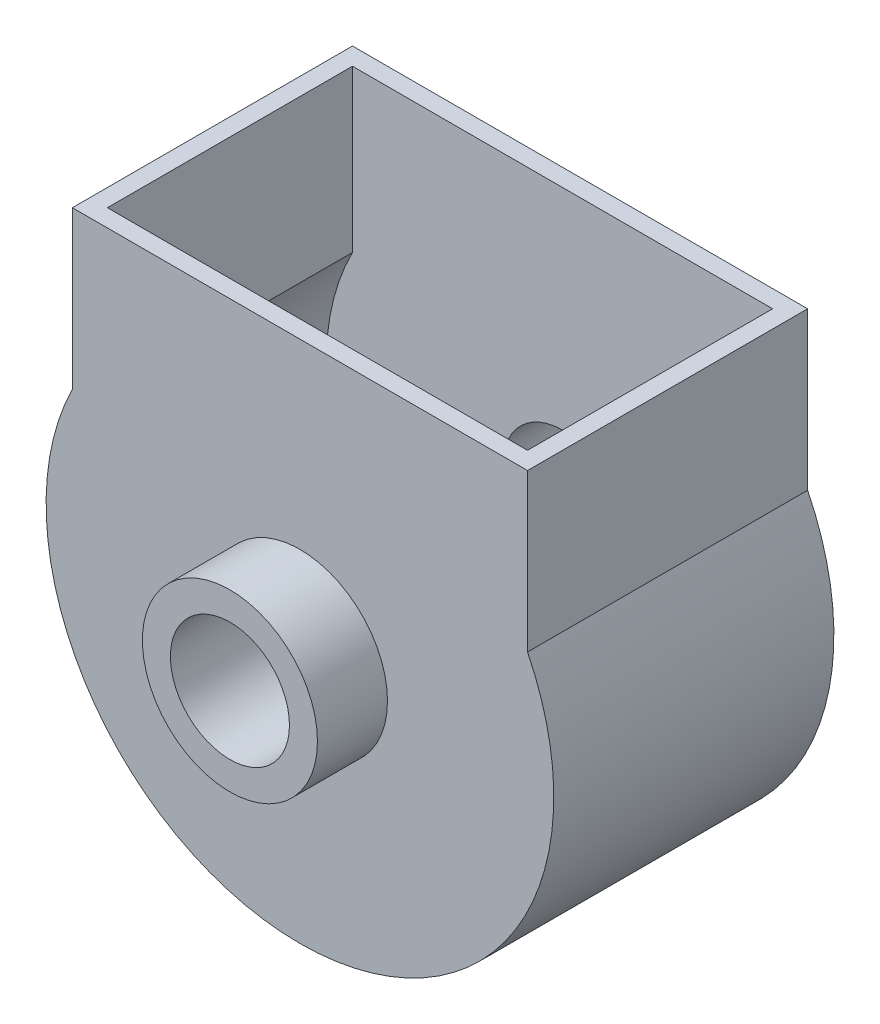
ISO-10303-21;
HEADER;
FILE_DESCRIPTION(('STEP AP214'),'2;1');
FILE_NAME('part.step','',(''),(''),'','','');
FILE_SCHEMA(('AUTOMOTIVE_DESIGN { 1 0 10303 214 1 1 1 1 }'));
ENDSEC;
DATA;
#1=APPLICATION_CONTEXT('core data for automotive mechanical design processes');
#2=APPLICATION_PROTOCOL_DEFINITION('international standard','automotive_design',2000,#1);
#3=PRODUCT_CONTEXT('',#1,'mechanical');
#4=PRODUCT('Part','Part','',(#3));
#5=PRODUCT_RELATED_PRODUCT_CATEGORY('part','',(#4));
#6=PRODUCT_DEFINITION_FORMATION('','',#4);
#7=PRODUCT_DEFINITION_CONTEXT('part definition',#1,'design');
#8=PRODUCT_DEFINITION('design','',#6,#7);
#9=PRODUCT_DEFINITION_SHAPE('','',#8);
#10=(LENGTH_UNIT() NAMED_UNIT(*) SI_UNIT(.MILLI.,.METRE.));
#11=(NAMED_UNIT(*) PLANE_ANGLE_UNIT() SI_UNIT($,.RADIAN.));
#12=(NAMED_UNIT(*) SI_UNIT($,.STERADIAN.) SOLID_ANGLE_UNIT());
#13=UNCERTAINTY_MEASURE_WITH_UNIT(LENGTH_MEASURE(1.E-05),#10,'distance_accuracy_value','');
#14=(GEOMETRIC_REPRESENTATION_CONTEXT(3) GLOBAL_UNCERTAINTY_ASSIGNED_CONTEXT((#13)) GLOBAL_UNIT_ASSIGNED_CONTEXT((#10,
#11,#12)) REPRESENTATION_CONTEXT('',''));
#15=CARTESIAN_POINT('',(0.,0.,0.));
#16=DIRECTION('',(0.,0.,1.));
#17=DIRECTION('',(1.,0.,0.));
#18=AXIS2_PLACEMENT_3D('',#15,#16,#17);
#19=CARTESIAN_POINT('',(0.,0.,-50.));
#20=DIRECTION('',(0.,0.,1.));
#21=DIRECTION('',(1.,0.,0.));
#22=AXIS2_PLACEMENT_3D('',#19,#20,#21);
#23=PLANE('',#22);
#24=CARTESIAN_POINT('',(0.,0.,-50.));
#25=DIRECTION('',(0.,0.,1.));
#26=DIRECTION('',(1.,0.,0.));
#27=AXIS2_PLACEMENT_3D('',#24,#25,#26);
#28=CIRCLE('',#27,170.);
#29=CARTESIAN_POINT('',(170.,0.,-50.));
#30=VERTEX_POINT('',#29);
#31=EDGE_CURVE('E52',#30,#30,#28,.T.);
#32=ORIENTED_EDGE('',*,*,#31,.T.);
#33=EDGE_LOOP('',(#32));
#34=FACE_BOUND('',#33,.T.);
#35=DIRECTION('',(0.,-1.,0.));
#36=VECTOR('',#35,1.);
#37=CARTESIAN_POINT('',(-600.,770.,-50.));
#38=LINE('',#37,#36);
#39=CARTESIAN_POINT('',(-600.,770.,-50.));
#40=VERTEX_POINT('',#39);
#41=CARTESIAN_POINT('',(-600.,309.232921921324,-50.));
#42=VERTEX_POINT('',#41);
#43=EDGE_CURVE('E165',#40,#42,#38,.T.);
#44=ORIENTED_EDGE('',*,*,#43,.F.);
#45=DIRECTION('',(-1.,0.,0.));
#46=VECTOR('',#45,1.);
#47=CARTESIAN_POINT('',(0.,770.,-50.));
#48=LINE('',#47,#46);
#49=CARTESIAN_POINT('',(600.,770.,-50.));
#50=VERTEX_POINT('',#49);
#51=EDGE_CURVE('E121',#50,#40,#48,.T.);
#52=ORIENTED_EDGE('',*,*,#51,.F.);
#53=DIRECTION('',(0.,1.,0.));
#54=VECTOR('',#53,1.);
#55=CARTESIAN_POINT('',(600.,309.232921921324,-50.));
#56=LINE('',#55,#54);
#57=CARTESIAN_POINT('',(600.,309.232921921324,-50.));
#58=VERTEX_POINT('',#57);
#59=EDGE_CURVE('E64',#58,#50,#56,.T.);
#60=ORIENTED_EDGE('',*,*,#59,.F.);
#61=CARTESIAN_POINT('',(0.,0.,-50.));
#62=DIRECTION('',(0.,0.,1.));
#63=DIRECTION('',(1.,0.,0.));
#64=AXIS2_PLACEMENT_3D('',#61,#62,#63);
#65=CIRCLE('',#64,675.);
#66=EDGE_CURVE('E59',#42,#58,#65,.T.);
#67=ORIENTED_EDGE('',*,*,#66,.F.);
#68=EDGE_LOOP('',(#44,#52,#60,#67));
#69=FACE_BOUND('',#68,.T.);
#70=ADVANCED_FACE('F43',(#34,#69),#23,.F.);
#71=CARTESIAN_POINT('',(0.,0.,-50.));
#72=DIRECTION('',(0.,0.,1.));
#73=DIRECTION('',(1.,0.,0.));
#74=AXIS2_PLACEMENT_3D('',#71,#72,#73);
#75=CYLINDRICAL_SURFACE('',#74,170.);
#76=ORIENTED_EDGE('',*,*,#31,.F.);
#77=EDGE_LOOP('',(#76));
#78=FACE_BOUND('',#77,.T.);
#79=CARTESIAN_POINT('',(0.,0.,200.));
#80=DIRECTION('',(0.,0.,1.));
#81=DIRECTION('',(1.,0.,0.));
#82=AXIS2_PLACEMENT_3D('',#79,#80,#81);
#83=CIRCLE('',#82,170.);
#84=CARTESIAN_POINT('',(170.,0.,200.));
#85=VERTEX_POINT('',#84);
#86=EDGE_CURVE('E213',#85,#85,#83,.T.);
#87=ORIENTED_EDGE('',*,*,#86,.T.);
#88=EDGE_LOOP('',(#87));
#89=FACE_BOUND('',#88,.T.);
#90=ADVANCED_FACE('F45',(#78,#89),#75,.F.);
#91=CARTESIAN_POINT('',(0.,0.,-50.));
#92=DIRECTION('',(0.,0.,1.));
#93=DIRECTION('',(1.,0.,0.));
#94=AXIS2_PLACEMENT_3D('',#91,#92,#93);
#95=CYLINDRICAL_SURFACE('',#94,250.);
#96=CARTESIAN_POINT('',(0.,0.,0.));
#97=DIRECTION('',(0.,0.,1.));
#98=DIRECTION('',(1.,0.,0.));
#99=AXIS2_PLACEMENT_3D('',#96,#97,#98);
#100=CIRCLE('',#99,250.);
#101=CARTESIAN_POINT('',(250.,0.,0.));
#102=VERTEX_POINT('',#101);
#103=EDGE_CURVE('E11',#102,#102,#100,.F.);
#104=ORIENTED_EDGE('',*,*,#103,.F.);
#105=EDGE_LOOP('',(#104));
#106=FACE_BOUND('',#105,.T.);
#107=CARTESIAN_POINT('',(0.,0.,200.));
#108=DIRECTION('',(0.,0.,1.));
#109=DIRECTION('',(1.,0.,0.));
#110=AXIS2_PLACEMENT_3D('',#107,#108,#109);
#111=CIRCLE('',#110,250.);
#112=CARTESIAN_POINT('',(250.,0.,200.));
#113=VERTEX_POINT('',#112);
#114=EDGE_CURVE('E222',#113,#113,#111,.T.);
#115=ORIENTED_EDGE('',*,*,#114,.F.);
#116=EDGE_LOOP('',(#115));
#117=FACE_BOUND('',#116,.T.);
#118=ADVANCED_FACE('F232',(#106,#117),#95,.T.);
#119=CARTESIAN_POINT('',(0.,0.,200.));
#120=DIRECTION('',(0.,0.,1.));
#121=DIRECTION('',(1.,0.,0.));
#122=AXIS2_PLACEMENT_3D('',#119,#120,#121);
#123=PLANE('',#122);
#124=ORIENTED_EDGE('',*,*,#86,.F.);
#125=EDGE_LOOP('',(#124));
#126=FACE_BOUND('',#125,.T.);
#127=ORIENTED_EDGE('',*,*,#114,.T.);
#128=EDGE_LOOP('',(#127));
#129=FACE_BOUND('',#128,.T.);
#130=ADVANCED_FACE('F235',(#126,#129),#123,.T.);
#131=CARTESIAN_POINT('',(-650.,0.,-50.));
#132=DIRECTION('',(-1.,0.,0.));
#133=DIRECTION('',(0.,0.,1.));
#134=AXIS2_PLACEMENT_3D('',#131,#132,#133);
#135=PLANE('',#134);
#136=DIRECTION('',(0.,-1.,0.));
#137=VECTOR('',#136,1.);
#138=CARTESIAN_POINT('',(-650.,0.,0.));
#139=LINE('',#138,#137);
#140=CARTESIAN_POINT('',(-650.,770.,0.));
#141=VERTEX_POINT('',#140);
#142=CARTESIAN_POINT('',(-650.,321.130814466628,0.));
#143=VERTEX_POINT('',#142);
#144=EDGE_CURVE('E185',#141,#143,#139,.T.);
#145=ORIENTED_EDGE('',*,*,#144,.F.);
#146=DIRECTION('',(0.,0.,1.));
#147=VECTOR('',#146,1.);
#148=CARTESIAN_POINT('',(-650.,770.,-50.));
#149=LINE('',#148,#147);
#150=CARTESIAN_POINT('',(-650.,770.,-800.));
#151=VERTEX_POINT('',#150);
#152=EDGE_CURVE('E133',#151,#141,#149,.T.);
#153=ORIENTED_EDGE('',*,*,#152,.F.);
#154=DIRECTION('',(0.,-1.,0.));
#155=VECTOR('',#154,1.);
#156=CARTESIAN_POINT('',(-650.,0.,-800.));
#157=LINE('',#156,#155);
#158=CARTESIAN_POINT('',(-650.,321.130814466628,-800.));
#159=VERTEX_POINT('',#158);
#160=EDGE_CURVE('E127',#151,#159,#157,.T.);
#161=ORIENTED_EDGE('',*,*,#160,.T.);
#162=DIRECTION('',(0.,0.,1.));
#163=VECTOR('',#162,1.);
#164=CARTESIAN_POINT('',(-650.,321.130814466628,-50.));
#165=LINE('',#164,#163);
#166=EDGE_CURVE('E108',#159,#143,#165,.T.);
#167=ORIENTED_EDGE('',*,*,#166,.T.);
#168=EDGE_LOOP('',(#145,#153,#161,#167));
#169=FACE_BOUND('',#168,.T.);
#170=ADVANCED_FACE('F132',(#169),#135,.T.);
#171=CARTESIAN_POINT('',(0.,770.,-50.));
#172=DIRECTION('',(0.,1.,0.));
#173=DIRECTION('',(0.,0.,1.));
#174=AXIS2_PLACEMENT_3D('',#171,#172,#173);
#175=PLANE('',#174);
#176=DIRECTION('',(-1.,0.,0.));
#177=VECTOR('',#176,1.);
#178=CARTESIAN_POINT('',(0.,770.,-750.));
#179=LINE('',#178,#177);
#180=CARTESIAN_POINT('',(600.,770.,-750.));
#181=VERTEX_POINT('',#180);
#182=CARTESIAN_POINT('',(-600.,770.,-750.));
#183=VERTEX_POINT('',#182);
#184=EDGE_CURVE('E138',#181,#183,#179,.T.);
#185=ORIENTED_EDGE('',*,*,#184,.F.);
#186=DIRECTION('',(0.,0.,1.));
#187=VECTOR('',#186,1.);
#188=CARTESIAN_POINT('',(600.,770.,-1000.002));
#189=LINE('',#188,#187);
#190=EDGE_CURVE('E170',#181,#50,#189,.T.);
#191=ORIENTED_EDGE('',*,*,#190,.T.);
#192=ORIENTED_EDGE('',*,*,#51,.T.);
#193=DIRECTION('',(0.,0.,1.));
#194=VECTOR('',#193,1.);
#195=CARTESIAN_POINT('',(-600.,770.,-1000.002));
#196=LINE('',#195,#194);
#197=EDGE_CURVE('E181',#183,#40,#196,.T.);
#198=ORIENTED_EDGE('',*,*,#197,.F.);
#199=EDGE_LOOP('',(#185,#191,#192,#198));
#200=FACE_BOUND('',#199,.T.);
#201=DIRECTION('',(-1.,0.,0.));
#202=VECTOR('',#201,1.);
#203=CARTESIAN_POINT('',(0.,770.,0.));
#204=LINE('',#203,#202);
#205=CARTESIAN_POINT('',(650.,770.,0.));
#206=VERTEX_POINT('',#205);
#207=EDGE_CURVE('E199',#206,#141,#204,.T.);
#208=ORIENTED_EDGE('',*,*,#207,.F.);
#209=DIRECTION('',(0.,0.,1.));
#210=VECTOR('',#209,1.);
#211=CARTESIAN_POINT('',(650.,770.,-50.));
#212=LINE('',#211,#210);
#213=CARTESIAN_POINT('',(650.,770.,-800.));
#214=VERTEX_POINT('',#213);
#215=EDGE_CURVE('E214',#214,#206,#212,.T.);
#216=ORIENTED_EDGE('',*,*,#215,.F.);
#217=DIRECTION('',(-1.,0.,0.));
#218=VECTOR('',#217,1.);
#219=CARTESIAN_POINT('',(0.,770.,-800.));
#220=LINE('',#219,#218);
#221=EDGE_CURVE('E142',#214,#151,#220,.T.);
#222=ORIENTED_EDGE('',*,*,#221,.T.);
#223=ORIENTED_EDGE('',*,*,#152,.T.);
#224=EDGE_LOOP('',(#208,#216,#222,#223));
#225=FACE_BOUND('',#224,.T.);
#226=ADVANCED_FACE('F253',(#200,#225),#175,.T.);
#227=CARTESIAN_POINT('',(650.,0.,-50.));
#228=DIRECTION('',(-1.,0.,0.));
#229=DIRECTION('',(0.,0.,1.));
#230=AXIS2_PLACEMENT_3D('',#227,#228,#229);
#231=PLANE('',#230);
#232=DIRECTION('',(0.,-1.,0.));
#233=VECTOR('',#232,1.);
#234=CARTESIAN_POINT('',(650.,0.,0.));
#235=LINE('',#234,#233);
#236=CARTESIAN_POINT('',(650.,321.130814466628,0.));
#237=VERTEX_POINT('',#236);
#238=EDGE_CURVE('E204',#206,#237,#235,.T.);
#239=ORIENTED_EDGE('',*,*,#238,.T.);
#240=DIRECTION('',(0.,0.,1.));
#241=VECTOR('',#240,1.);
#242=CARTESIAN_POINT('',(650.,321.130814466628,-50.));
#243=LINE('',#242,#241);
#244=CARTESIAN_POINT('',(650.,321.130814466628,-800.));
#245=VERTEX_POINT('',#244);
#246=EDGE_CURVE('E120',#245,#237,#243,.T.);
#247=ORIENTED_EDGE('',*,*,#246,.F.);
#248=DIRECTION('',(0.,-1.,0.));
#249=VECTOR('',#248,1.);
#250=CARTESIAN_POINT('',(650.,0.,-800.));
#251=LINE('',#250,#249);
#252=EDGE_CURVE('E129',#214,#245,#251,.T.);
#253=ORIENTED_EDGE('',*,*,#252,.F.);
#254=ORIENTED_EDGE('',*,*,#215,.T.);
#255=EDGE_LOOP('',(#239,#247,#253,#254));
#256=FACE_BOUND('',#255,.T.);
#257=ADVANCED_FACE('F257',(#256),#231,.F.);
#258=CARTESIAN_POINT('',(0.,0.,-50.));
#259=DIRECTION('',(0.,0.,1.));
#260=DIRECTION('',(1.,0.,0.));
#261=AXIS2_PLACEMENT_3D('',#258,#259,#260);
#262=CYLINDRICAL_SURFACE('',#261,725.);
#263=CARTESIAN_POINT('',(0.,0.,0.));
#264=DIRECTION('',(0.,0.,1.));
#265=DIRECTION('',(1.,0.,0.));
#266=AXIS2_PLACEMENT_3D('',#263,#264,#265);
#267=CIRCLE('',#266,725.);
#268=EDGE_CURVE('E114',#143,#237,#267,.T.);
#269=ORIENTED_EDGE('',*,*,#268,.F.);
#270=ORIENTED_EDGE('',*,*,#166,.F.);
#271=CARTESIAN_POINT('',(0.,0.,-800.));
#272=DIRECTION('',(0.,0.,1.));
#273=DIRECTION('',(1.,0.,0.));
#274=AXIS2_PLACEMENT_3D('',#271,#272,#273);
#275=CIRCLE('',#274,725.);
#276=EDGE_CURVE('E111',#159,#245,#275,.T.);
#277=ORIENTED_EDGE('',*,*,#276,.T.);
#278=ORIENTED_EDGE('',*,*,#246,.T.);
#279=EDGE_LOOP('',(#269,#270,#277,#278));
#280=FACE_BOUND('',#279,.T.);
#281=ADVANCED_FACE('F110',(#280),#262,.T.);
#282=CARTESIAN_POINT('',(0.,0.,0.));
#283=DIRECTION('',(0.,0.,1.));
#284=DIRECTION('',(1.,0.,0.));
#285=AXIS2_PLACEMENT_3D('',#282,#283,#284);
#286=PLANE('',#285);
#287=ORIENTED_EDGE('',*,*,#103,.T.);
#288=EDGE_LOOP('',(#287));
#289=FACE_BOUND('',#288,.T.);
#290=ORIENTED_EDGE('',*,*,#144,.T.);
#291=ORIENTED_EDGE('',*,*,#268,.T.);
#292=ORIENTED_EDGE('',*,*,#238,.F.);
#293=ORIENTED_EDGE('',*,*,#207,.T.);
#294=EDGE_LOOP('',(#290,#291,#292,#293));
#295=FACE_BOUND('',#294,.T.);
#296=ADVANCED_FACE('F256',(#289,#295),#286,.T.);
#297=CARTESIAN_POINT('',(600.,309.232921921324,-1000.002));
#298=DIRECTION('',(1.,0.,0.));
#299=DIRECTION('',(0.,0.,-1.));
#300=AXIS2_PLACEMENT_3D('',#297,#298,#299);
#301=PLANE('',#300);
#302=DIRECTION('',(0.,1.,0.));
#303=VECTOR('',#302,1.);
#304=CARTESIAN_POINT('',(600.,309.232921921324,-750.));
#305=LINE('',#304,#303);
#306=CARTESIAN_POINT('',(600.,309.232921921324,-750.));
#307=VERTEX_POINT('',#306);
#308=EDGE_CURVE('E175',#307,#181,#305,.T.);
#309=ORIENTED_EDGE('',*,*,#308,.F.);
#310=DIRECTION('',(0.,0.,1.));
#311=VECTOR('',#310,1.);
#312=CARTESIAN_POINT('',(600.,309.232921921324,-1000.002));
#313=LINE('',#312,#311);
#314=EDGE_CURVE('E174',#307,#58,#313,.T.);
#315=ORIENTED_EDGE('',*,*,#314,.T.);
#316=ORIENTED_EDGE('',*,*,#59,.T.);
#317=ORIENTED_EDGE('',*,*,#190,.F.);
#318=EDGE_LOOP('',(#309,#315,#316,#317));
#319=FACE_BOUND('',#318,.T.);
#320=ADVANCED_FACE('F266',(#319),#301,.F.);
#321=CARTESIAN_POINT('',(0.,0.,-1000.002));
#322=DIRECTION('',(0.,0.,1.));
#323=DIRECTION('',(1.,0.,0.));
#324=AXIS2_PLACEMENT_3D('',#321,#322,#323);
#325=CYLINDRICAL_SURFACE('',#324,675.);
#326=CARTESIAN_POINT('',(0.,0.,-750.));
#327=DIRECTION('',(0.,0.,-1.));
#328=DIRECTION('',(-1.,0.,0.));
#329=AXIS2_PLACEMENT_3D('',#326,#327,#328);
#330=CIRCLE('',#329,675.);
#331=CARTESIAN_POINT('',(-600.,309.232921921324,-750.));
#332=VERTEX_POINT('',#331);
#333=EDGE_CURVE('E189',#332,#307,#330,.F.);
#334=ORIENTED_EDGE('',*,*,#333,.F.);
#335=DIRECTION('',(0.,0.,1.));
#336=VECTOR('',#335,1.);
#337=CARTESIAN_POINT('',(-600.,309.232921921324,-1000.002));
#338=LINE('',#337,#336);
#339=EDGE_CURVE('E178',#332,#42,#338,.T.);
#340=ORIENTED_EDGE('',*,*,#339,.T.);
#341=ORIENTED_EDGE('',*,*,#66,.T.);
#342=ORIENTED_EDGE('',*,*,#314,.F.);
#343=EDGE_LOOP('',(#334,#340,#341,#342));
#344=FACE_BOUND('',#343,.T.);
#345=ADVANCED_FACE('F272',(#344),#325,.F.);
#346=CARTESIAN_POINT('',(-600.,770.,-1000.002));
#347=DIRECTION('',(-1.,0.,0.));
#348=DIRECTION('',(0.,0.,1.));
#349=AXIS2_PLACEMENT_3D('',#346,#347,#348);
#350=PLANE('',#349);
#351=DIRECTION('',(0.,-1.,0.));
#352=VECTOR('',#351,1.);
#353=CARTESIAN_POINT('',(-600.,770.,-750.));
#354=LINE('',#353,#352);
#355=EDGE_CURVE('E169',#183,#332,#354,.T.);
#356=ORIENTED_EDGE('',*,*,#355,.F.);
#357=ORIENTED_EDGE('',*,*,#197,.T.);
#358=ORIENTED_EDGE('',*,*,#43,.T.);
#359=ORIENTED_EDGE('',*,*,#339,.F.);
#360=EDGE_LOOP('',(#356,#357,#358,#359));
#361=FACE_BOUND('',#360,.T.);
#362=ADVANCED_FACE('F268',(#361),#350,.F.);
#363=CARTESIAN_POINT('',(0.,0.,-750.));
#364=DIRECTION('',(0.,0.,-1.));
#365=DIRECTION('',(1.,0.,0.));
#366=AXIS2_PLACEMENT_3D('',#363,#364,#365);
#367=PLANE('',#366);
#368=CARTESIAN_POINT('',(0.,0.,-750.));
#369=DIRECTION('',(0.,0.,1.));
#370=DIRECTION('',(1.,0.,0.));
#371=AXIS2_PLACEMENT_3D('',#368,#369,#370);
#372=CIRCLE('',#371,170.);
#373=CARTESIAN_POINT('',(170.,0.,-750.));
#374=VERTEX_POINT('',#373);
#375=EDGE_CURVE('E153',#374,#374,#372,.T.);
#376=ORIENTED_EDGE('',*,*,#375,.F.);
#377=EDGE_LOOP('',(#376));
#378=FACE_BOUND('',#377,.T.);
#379=ORIENTED_EDGE('',*,*,#333,.T.);
#380=ORIENTED_EDGE('',*,*,#308,.T.);
#381=ORIENTED_EDGE('',*,*,#184,.T.);
#382=ORIENTED_EDGE('',*,*,#355,.T.);
#383=EDGE_LOOP('',(#379,#380,#381,#382));
#384=FACE_BOUND('',#383,.T.);
#385=ADVANCED_FACE('F271',(#378,#384),#367,.F.);
#386=CARTESIAN_POINT('',(0.,0.,-750.));
#387=DIRECTION('',(0.,0.,-1.));
#388=DIRECTION('',(1.,0.,0.));
#389=AXIS2_PLACEMENT_3D('',#386,#387,#388);
#390=CYLINDRICAL_SURFACE('',#389,170.);
#391=ORIENTED_EDGE('',*,*,#375,.T.);
#392=EDGE_LOOP('',(#391));
#393=FACE_BOUND('',#392,.T.);
#394=CARTESIAN_POINT('',(0.,0.,-1000.));
#395=DIRECTION('',(0.,0.,1.));
#396=DIRECTION('',(1.,0.,0.));
#397=AXIS2_PLACEMENT_3D('',#394,#395,#396);
#398=CIRCLE('',#397,170.);
#399=CARTESIAN_POINT('',(170.,0.,-1000.));
#400=VERTEX_POINT('',#399);
#401=EDGE_CURVE('E145',#400,#400,#398,.T.);
#402=ORIENTED_EDGE('',*,*,#401,.F.);
#403=EDGE_LOOP('',(#402));
#404=FACE_BOUND('',#403,.T.);
#405=ADVANCED_FACE('F280',(#393,#404),#390,.F.);
#406=CARTESIAN_POINT('',(0.,0.,-750.));
#407=DIRECTION('',(0.,0.,-1.));
#408=DIRECTION('',(1.,0.,0.));
#409=AXIS2_PLACEMENT_3D('',#406,#407,#408);
#410=CYLINDRICAL_SURFACE('',#409,250.);
#411=CARTESIAN_POINT('',(0.,0.,-800.));
#412=DIRECTION('',(0.,0.,1.));
#413=DIRECTION('',(1.,0.,0.));
#414=AXIS2_PLACEMENT_3D('',#411,#412,#413);
#415=CIRCLE('',#414,250.);
#416=CARTESIAN_POINT('',(250.,0.,-800.));
#417=VERTEX_POINT('',#416);
#418=EDGE_CURVE('E157',#417,#417,#415,.F.);
#419=ORIENTED_EDGE('',*,*,#418,.T.);
#420=EDGE_LOOP('',(#419));
#421=FACE_BOUND('',#420,.T.);
#422=CARTESIAN_POINT('',(0.,0.,-1000.));
#423=DIRECTION('',(0.,0.,1.));
#424=DIRECTION('',(1.,0.,0.));
#425=AXIS2_PLACEMENT_3D('',#422,#423,#424);
#426=CIRCLE('',#425,250.);
#427=CARTESIAN_POINT('',(250.,0.,-1000.));
#428=VERTEX_POINT('',#427);
#429=EDGE_CURVE('E149',#428,#428,#426,.T.);
#430=ORIENTED_EDGE('',*,*,#429,.T.);
#431=EDGE_LOOP('',(#430));
#432=FACE_BOUND('',#431,.T.);
#433=ADVANCED_FACE('F283',(#421,#432),#410,.T.);
#434=CARTESIAN_POINT('',(0.,0.,-1000.));
#435=DIRECTION('',(0.,0.,-1.));
#436=DIRECTION('',(1.,0.,0.));
#437=AXIS2_PLACEMENT_3D('',#434,#435,#436);
#438=PLANE('',#437);
#439=ORIENTED_EDGE('',*,*,#401,.T.);
#440=EDGE_LOOP('',(#439));
#441=FACE_BOUND('',#440,.T.);
#442=ORIENTED_EDGE('',*,*,#429,.F.);
#443=EDGE_LOOP('',(#442));
#444=FACE_BOUND('',#443,.T.);
#445=ADVANCED_FACE('F287',(#441,#444),#438,.T.);
#446=CARTESIAN_POINT('',(0.,0.,-800.));
#447=DIRECTION('',(0.,0.,-1.));
#448=DIRECTION('',(1.,0.,0.));
#449=AXIS2_PLACEMENT_3D('',#446,#447,#448);
#450=PLANE('',#449);
#451=ORIENTED_EDGE('',*,*,#418,.F.);
#452=EDGE_LOOP('',(#451));
#453=FACE_BOUND('',#452,.T.);
#454=ORIENTED_EDGE('',*,*,#160,.F.);
#455=ORIENTED_EDGE('',*,*,#221,.F.);
#456=ORIENTED_EDGE('',*,*,#252,.T.);
#457=ORIENTED_EDGE('',*,*,#276,.F.);
#458=EDGE_LOOP('',(#454,#455,#456,#457));
#459=FACE_BOUND('',#458,.T.);
#460=ADVANCED_FACE('F125',(#453,#459),#450,.T.);
#461=CLOSED_SHELL('',(#70,#90,#118,#130,#170,#226,#257,#281,#296,#320,#345,#362,#385,#405,#433,
#445,#460));
#462=MANIFOLD_SOLID_BREP('B2',#461);
#463=ADVANCED_BREP_SHAPE_REPRESENTATION('',(#18,#462),#14);
#464=SHAPE_DEFINITION_REPRESENTATION(#9,#463);
ENDSEC;
END-ISO-10303-21;
